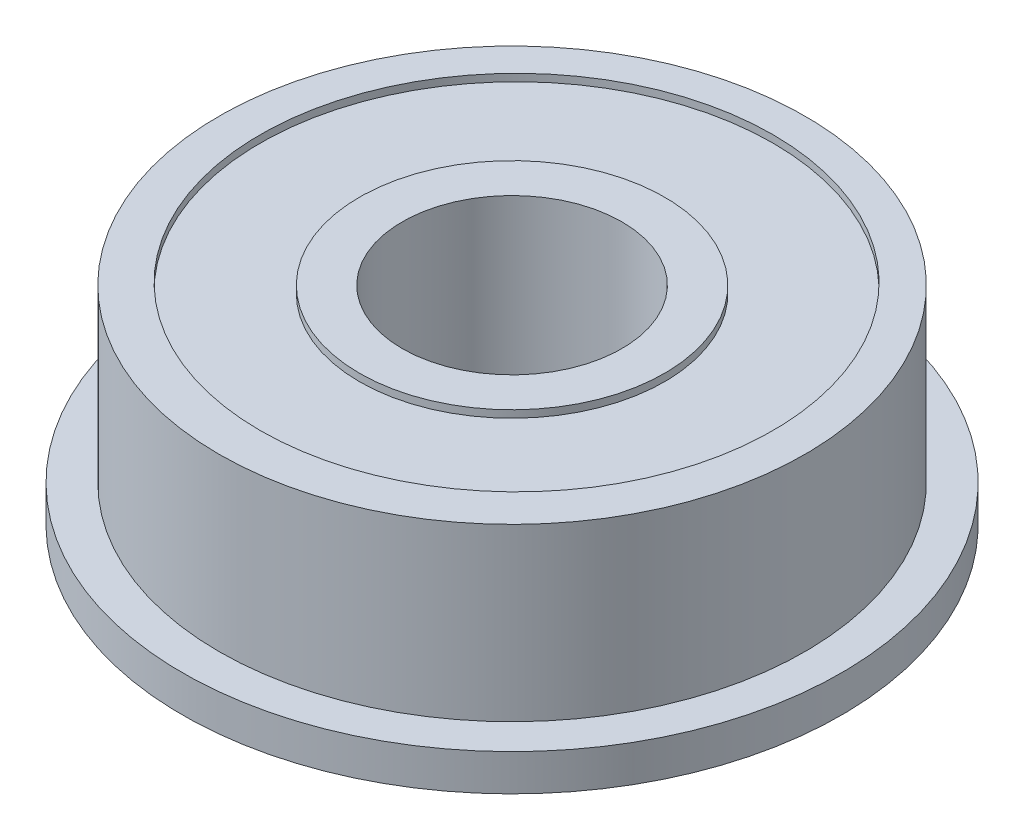
ISO-10303-21;
HEADER;
FILE_DESCRIPTION(('STEP AP214'),'2;1');
FILE_NAME('part.step','',(''),(''),'','','');
FILE_SCHEMA(('AUTOMOTIVE_DESIGN { 1 0 10303 214 1 1 1 1 }'));
ENDSEC;
DATA;
#1=APPLICATION_CONTEXT('core data for automotive mechanical design processes');
#2=APPLICATION_PROTOCOL_DEFINITION('international standard','automotive_design',2000,#1);
#3=PRODUCT_CONTEXT('',#1,'mechanical');
#4=PRODUCT('Part','Part','',(#3));
#5=PRODUCT_RELATED_PRODUCT_CATEGORY('part','',(#4));
#6=PRODUCT_DEFINITION_FORMATION('','',#4);
#7=PRODUCT_DEFINITION_CONTEXT('part definition',#1,'design');
#8=PRODUCT_DEFINITION('design','',#6,#7);
#9=PRODUCT_DEFINITION_SHAPE('','',#8);
#10=(LENGTH_UNIT() NAMED_UNIT(*) SI_UNIT(.MILLI.,.METRE.));
#11=(NAMED_UNIT(*) PLANE_ANGLE_UNIT() SI_UNIT($,.RADIAN.));
#12=(NAMED_UNIT(*) SI_UNIT($,.STERADIAN.) SOLID_ANGLE_UNIT());
#13=UNCERTAINTY_MEASURE_WITH_UNIT(LENGTH_MEASURE(1.E-05),#10,'distance_accuracy_value','');
#14=(GEOMETRIC_REPRESENTATION_CONTEXT(3) GLOBAL_UNCERTAINTY_ASSIGNED_CONTEXT((#13)) GLOBAL_UNIT_ASSIGNED_CONTEXT((#10,
#11,#12)) REPRESENTATION_CONTEXT('',''));
#15=CARTESIAN_POINT('',(0.,0.,0.));
#16=DIRECTION('',(0.,0.,1.));
#17=DIRECTION('',(1.,0.,0.));
#18=AXIS2_PLACEMENT_3D('',#15,#16,#17);
#19=CARTESIAN_POINT('',(0.,-1.5,0.));
#20=DIRECTION('',(0.,-1.,0.));
#21=DIRECTION('',(0.,0.,-1.));
#22=AXIS2_PLACEMENT_3D('',#19,#20,#21);
#23=PLANE('',#22);
#24=CARTESIAN_POINT('',(0.,-1.5,0.));
#25=DIRECTION('',(0.,-1.,0.));
#26=DIRECTION('',(0.,0.,-1.));
#27=AXIS2_PLACEMENT_3D('',#24,#25,#26);
#28=CIRCLE('',#27,4.5);
#29=CARTESIAN_POINT('',(0.,-1.5,-4.5));
#30=VERTEX_POINT('',#29);
#31=EDGE_CURVE('E55',#30,#30,#28,.T.);
#32=ORIENTED_EDGE('',*,*,#31,.F.);
#33=EDGE_LOOP('',(#32));
#34=FACE_BOUND('',#33,.T.);
#35=CARTESIAN_POINT('',(0.,-1.5,0.));
#36=DIRECTION('',(0.,-1.,0.));
#37=DIRECTION('',(0.,0.,-1.));
#38=AXIS2_PLACEMENT_3D('',#35,#36,#37);
#39=CIRCLE('',#38,6.25);
#40=CARTESIAN_POINT('',(0.,-1.5,-6.25));
#41=VERTEX_POINT('',#40);
#42=EDGE_CURVE('E79',#41,#41,#39,.T.);
#43=ORIENTED_EDGE('',*,*,#42,.T.);
#44=EDGE_LOOP('',(#43));
#45=FACE_BOUND('',#44,.T.);
#46=ADVANCED_FACE('F37',(#34,#45),#23,.T.);
#47=CARTESIAN_POINT('',(0.,7.,0.));
#48=DIRECTION('',(0.,1.,0.));
#49=DIRECTION('',(0.,0.,1.));
#50=AXIS2_PLACEMENT_3D('',#47,#48,#49);
#51=PLANE('',#50);
#52=CARTESIAN_POINT('',(0.,7.,0.));
#53=DIRECTION('',(0.,1.,0.));
#54=DIRECTION('',(0.,0.,1.));
#55=AXIS2_PLACEMENT_3D('',#52,#53,#54);
#56=CIRCLE('',#55,4.5);
#57=CARTESIAN_POINT('',(0.,7.,4.5));
#58=VERTEX_POINT('',#57);
#59=EDGE_CURVE('E45',#58,#58,#56,.T.);
#60=ORIENTED_EDGE('',*,*,#59,.F.);
#61=EDGE_LOOP('',(#60));
#62=FACE_BOUND('',#61,.T.);
#63=CARTESIAN_POINT('',(0.,7.,0.));
#64=DIRECTION('',(0.,1.,0.));
#65=DIRECTION('',(0.,0.,1.));
#66=AXIS2_PLACEMENT_3D('',#63,#64,#65);
#67=CIRCLE('',#66,6.25);
#68=CARTESIAN_POINT('',(0.,7.,6.25));
#69=VERTEX_POINT('',#68);
#70=EDGE_CURVE('E67',#69,#69,#67,.T.);
#71=ORIENTED_EDGE('',*,*,#70,.T.);
#72=EDGE_LOOP('',(#71));
#73=FACE_BOUND('',#72,.T.);
#74=ADVANCED_FACE('F123',(#62,#73),#51,.T.);
#75=CARTESIAN_POINT('',(0.,7.,-0.185580924530449));
#76=DIRECTION('',(0.,1.,0.));
#77=DIRECTION('',(0.,0.,1.));
#78=AXIS2_PLACEMENT_3D('',#75,#76,#77);
#79=CIRCLE('',#78,10.5);
#80=CARTESIAN_POINT('',(0.,7.,10.3144190754696));
#81=VERTEX_POINT('',#80);
#82=EDGE_CURVE('E61',#81,#81,#79,.T.);
#83=ORIENTED_EDGE('',*,*,#82,.F.);
#84=EDGE_LOOP('',(#83));
#85=FACE_BOUND('',#84,.T.);
#86=CARTESIAN_POINT('',(0.,7.,0.));
#87=DIRECTION('',(0.,1.,0.));
#88=DIRECTION('',(0.,0.,1.));
#89=AXIS2_PLACEMENT_3D('',#86,#87,#88);
#90=CIRCLE('',#89,12.);
#91=CARTESIAN_POINT('',(0.,7.,12.));
#92=VERTEX_POINT('',#91);
#93=EDGE_CURVE('E10',#92,#92,#90,.T.);
#94=ORIENTED_EDGE('',*,*,#93,.T.);
#95=EDGE_LOOP('',(#94));
#96=FACE_BOUND('',#95,.T.);
#97=ADVANCED_FACE('F128',(#85,#96),#51,.T.);
#98=CARTESIAN_POINT('',(0.,7.,0.));
#99=DIRECTION('',(0.,-1.,0.));
#100=DIRECTION('',(0.,0.,-1.));
#101=AXIS2_PLACEMENT_3D('',#98,#99,#100);
#102=CYLINDRICAL_SURFACE('',#101,12.);
#103=ORIENTED_EDGE('',*,*,#93,.F.);
#104=EDGE_LOOP('',(#103));
#105=FACE_BOUND('',#104,.T.);
#106=CARTESIAN_POINT('',(0.,0.,0.));
#107=DIRECTION('',(0.,1.,0.));
#108=DIRECTION('',(0.,0.,1.));
#109=AXIS2_PLACEMENT_3D('',#106,#107,#108);
#110=CIRCLE('',#109,12.);
#111=CARTESIAN_POINT('',(0.,0.,12.));
#112=VERTEX_POINT('',#111);
#113=EDGE_CURVE('E41',#112,#112,#110,.T.);
#114=ORIENTED_EDGE('',*,*,#113,.T.);
#115=EDGE_LOOP('',(#114));
#116=FACE_BOUND('',#115,.T.);
#117=ADVANCED_FACE('F39',(#105,#116),#102,.T.);
#118=CARTESIAN_POINT('',(0.,7.,0.));
#119=DIRECTION('',(0.,-1.,0.));
#120=DIRECTION('',(0.,0.,-1.));
#121=AXIS2_PLACEMENT_3D('',#118,#119,#120);
#122=CYLINDRICAL_SURFACE('',#121,4.5);
#123=ORIENTED_EDGE('',*,*,#59,.T.);
#124=EDGE_LOOP('',(#123));
#125=FACE_BOUND('',#124,.T.);
#126=ORIENTED_EDGE('',*,*,#31,.T.);
#127=EDGE_LOOP('',(#126));
#128=FACE_BOUND('',#127,.T.);
#129=ADVANCED_FACE('F105',(#125,#128),#122,.F.);
#130=CARTESIAN_POINT('',(0.,-1.5,0.));
#131=DIRECTION('',(0.,-1.,0.));
#132=DIRECTION('',(0.,0.,-1.));
#133=AXIS2_PLACEMENT_3D('',#130,#131,#132);
#134=CIRCLE('',#133,10.5);
#135=CARTESIAN_POINT('',(0.,-1.5,-10.5));
#136=VERTEX_POINT('',#135);
#137=EDGE_CURVE('E73',#136,#136,#134,.T.);
#138=ORIENTED_EDGE('',*,*,#137,.F.);
#139=EDGE_LOOP('',(#138));
#140=FACE_BOUND('',#139,.T.);
#141=CARTESIAN_POINT('',(0.,-1.5,0.));
#142=DIRECTION('',(0.,-1.,0.));
#143=DIRECTION('',(0.,0.,-1.));
#144=AXIS2_PLACEMENT_3D('',#141,#142,#143);
#145=CIRCLE('',#144,13.5);
#146=CARTESIAN_POINT('',(0.,-1.5,-13.5));
#147=VERTEX_POINT('',#146);
#148=EDGE_CURVE('E54',#147,#147,#145,.T.);
#149=ORIENTED_EDGE('',*,*,#148,.T.);
#150=EDGE_LOOP('',(#149));
#151=FACE_BOUND('',#150,.T.);
#152=ADVANCED_FACE('F101',(#140,#151),#23,.T.);
#153=CARTESIAN_POINT('',(0.,0.,0.));
#154=DIRECTION('',(0.,-1.,0.));
#155=DIRECTION('',(0.,0.,-1.));
#156=AXIS2_PLACEMENT_3D('',#153,#154,#155);
#157=PLANE('',#156);
#158=ORIENTED_EDGE('',*,*,#113,.F.);
#159=EDGE_LOOP('',(#158));
#160=FACE_BOUND('',#159,.T.);
#161=CARTESIAN_POINT('',(0.,0.,0.));
#162=DIRECTION('',(0.,-1.,0.));
#163=DIRECTION('',(0.,0.,-1.));
#164=AXIS2_PLACEMENT_3D('',#161,#162,#163);
#165=CIRCLE('',#164,13.5);
#166=CARTESIAN_POINT('',(0.,0.,-13.5));
#167=VERTEX_POINT('',#166);
#168=EDGE_CURVE('E51',#167,#167,#165,.T.);
#169=ORIENTED_EDGE('',*,*,#168,.F.);
#170=EDGE_LOOP('',(#169));
#171=FACE_BOUND('',#170,.T.);
#172=ADVANCED_FACE('F104',(#160,#171),#157,.F.);
#173=CARTESIAN_POINT('',(0.,-1.5,0.));
#174=DIRECTION('',(0.,1.,0.));
#175=DIRECTION('',(0.,0.,1.));
#176=AXIS2_PLACEMENT_3D('',#173,#174,#175);
#177=CYLINDRICAL_SURFACE('',#176,13.5);
#178=ORIENTED_EDGE('',*,*,#148,.F.);
#179=EDGE_LOOP('',(#178));
#180=FACE_BOUND('',#179,.T.);
#181=ORIENTED_EDGE('',*,*,#168,.T.);
#182=EDGE_LOOP('',(#181));
#183=FACE_BOUND('',#182,.T.);
#184=ADVANCED_FACE('F109',(#180,#183),#177,.T.);
#185=CARTESIAN_POINT('',(0.,6.7,-0.185580924530449));
#186=DIRECTION('',(0.,1.,0.));
#187=DIRECTION('',(0.,0.,1.));
#188=AXIS2_PLACEMENT_3D('',#185,#186,#187);
#189=CYLINDRICAL_SURFACE('',#188,10.5);
#190=CARTESIAN_POINT('',(0.,6.7,-0.185580924530449));
#191=DIRECTION('',(0.,1.,0.));
#192=DIRECTION('',(0.,0.,1.));
#193=AXIS2_PLACEMENT_3D('',#190,#191,#192);
#194=CIRCLE('',#193,10.5);
#195=CARTESIAN_POINT('',(0.,6.7,10.3144190754696));
#196=VERTEX_POINT('',#195);
#197=EDGE_CURVE('E60',#196,#196,#194,.T.);
#198=ORIENTED_EDGE('',*,*,#197,.F.);
#199=EDGE_LOOP('',(#198));
#200=FACE_BOUND('',#199,.T.);
#201=ORIENTED_EDGE('',*,*,#82,.T.);
#202=EDGE_LOOP('',(#201));
#203=FACE_BOUND('',#202,.T.);
#204=ADVANCED_FACE('F112',(#200,#203),#189,.F.);
#205=CARTESIAN_POINT('',(0.,6.7,-0.185580924530449));
#206=DIRECTION('',(0.,1.,0.));
#207=DIRECTION('',(0.,0.,1.));
#208=AXIS2_PLACEMENT_3D('',#205,#206,#207);
#209=PLANE('',#208);
#210=CARTESIAN_POINT('',(0.,6.7,0.));
#211=DIRECTION('',(0.,1.,0.));
#212=DIRECTION('',(0.,0.,1.));
#213=AXIS2_PLACEMENT_3D('',#210,#211,#212);
#214=CIRCLE('',#213,6.25);
#215=CARTESIAN_POINT('',(0.,6.7,6.25));
#216=VERTEX_POINT('',#215);
#217=EDGE_CURVE('E64',#216,#216,#214,.T.);
#218=ORIENTED_EDGE('',*,*,#217,.F.);
#219=EDGE_LOOP('',(#218));
#220=FACE_BOUND('',#219,.T.);
#221=ORIENTED_EDGE('',*,*,#197,.T.);
#222=EDGE_LOOP('',(#221));
#223=FACE_BOUND('',#222,.T.);
#224=ADVANCED_FACE('F135',(#220,#223),#209,.T.);
#225=CARTESIAN_POINT('',(0.,6.7,0.));
#226=DIRECTION('',(0.,1.,0.));
#227=DIRECTION('',(0.,0.,1.));
#228=AXIS2_PLACEMENT_3D('',#225,#226,#227);
#229=CYLINDRICAL_SURFACE('',#228,6.25);
#230=ORIENTED_EDGE('',*,*,#217,.T.);
#231=EDGE_LOOP('',(#230));
#232=FACE_BOUND('',#231,.T.);
#233=ORIENTED_EDGE('',*,*,#70,.F.);
#234=EDGE_LOOP('',(#233));
#235=FACE_BOUND('',#234,.T.);
#236=ADVANCED_FACE('F97',(#232,#235),#229,.T.);
#237=CARTESIAN_POINT('',(0.,-1.2,0.));
#238=DIRECTION('',(0.,-1.,0.));
#239=DIRECTION('',(0.,0.,-1.));
#240=AXIS2_PLACEMENT_3D('',#237,#238,#239);
#241=CYLINDRICAL_SURFACE('',#240,10.5);
#242=CARTESIAN_POINT('',(0.,-1.2,0.));
#243=DIRECTION('',(0.,-1.,0.));
#244=DIRECTION('',(0.,0.,-1.));
#245=AXIS2_PLACEMENT_3D('',#242,#243,#244);
#246=CIRCLE('',#245,10.5);
#247=CARTESIAN_POINT('',(0.,-1.2,-10.5));
#248=VERTEX_POINT('',#247);
#249=EDGE_CURVE('E70',#248,#248,#246,.T.);
#250=ORIENTED_EDGE('',*,*,#249,.F.);
#251=EDGE_LOOP('',(#250));
#252=FACE_BOUND('',#251,.T.);
#253=ORIENTED_EDGE('',*,*,#137,.T.);
#254=EDGE_LOOP('',(#253));
#255=FACE_BOUND('',#254,.T.);
#256=ADVANCED_FACE('F91',(#252,#255),#241,.F.);
#257=CARTESIAN_POINT('',(0.,-1.2,0.));
#258=DIRECTION('',(0.,-1.,0.));
#259=DIRECTION('',(0.,0.,-1.));
#260=AXIS2_PLACEMENT_3D('',#257,#258,#259);
#261=PLANE('',#260);
#262=CARTESIAN_POINT('',(0.,-1.2,0.));
#263=DIRECTION('',(0.,-1.,0.));
#264=DIRECTION('',(0.,0.,-1.));
#265=AXIS2_PLACEMENT_3D('',#262,#263,#264);
#266=CIRCLE('',#265,6.25);
#267=CARTESIAN_POINT('',(0.,-1.2,-6.25));
#268=VERTEX_POINT('',#267);
#269=EDGE_CURVE('E76',#268,#268,#266,.T.);
#270=ORIENTED_EDGE('',*,*,#269,.F.);
#271=EDGE_LOOP('',(#270));
#272=FACE_BOUND('',#271,.T.);
#273=ORIENTED_EDGE('',*,*,#249,.T.);
#274=EDGE_LOOP('',(#273));
#275=FACE_BOUND('',#274,.T.);
#276=ADVANCED_FACE('F88',(#272,#275),#261,.T.);
#277=CARTESIAN_POINT('',(0.,-1.2,0.));
#278=DIRECTION('',(0.,-1.,0.));
#279=DIRECTION('',(0.,0.,-1.));
#280=AXIS2_PLACEMENT_3D('',#277,#278,#279);
#281=CYLINDRICAL_SURFACE('',#280,6.25);
#282=ORIENTED_EDGE('',*,*,#269,.T.);
#283=EDGE_LOOP('',(#282));
#284=FACE_BOUND('',#283,.T.);
#285=ORIENTED_EDGE('',*,*,#42,.F.);
#286=EDGE_LOOP('',(#285));
#287=FACE_BOUND('',#286,.T.);
#288=ADVANCED_FACE('F85',(#284,#287),#281,.T.);
#289=CLOSED_SHELL('',(#46,#74,#97,#117,#129,#152,#172,#184,#204,#224,#236,#256,#276,#288));
#290=MANIFOLD_SOLID_BREP('B2',#289);
#291=ADVANCED_BREP_SHAPE_REPRESENTATION('',(#18,#290),#14);
#292=SHAPE_DEFINITION_REPRESENTATION(#9,#291);
ENDSEC;
END-ISO-10303-21;
